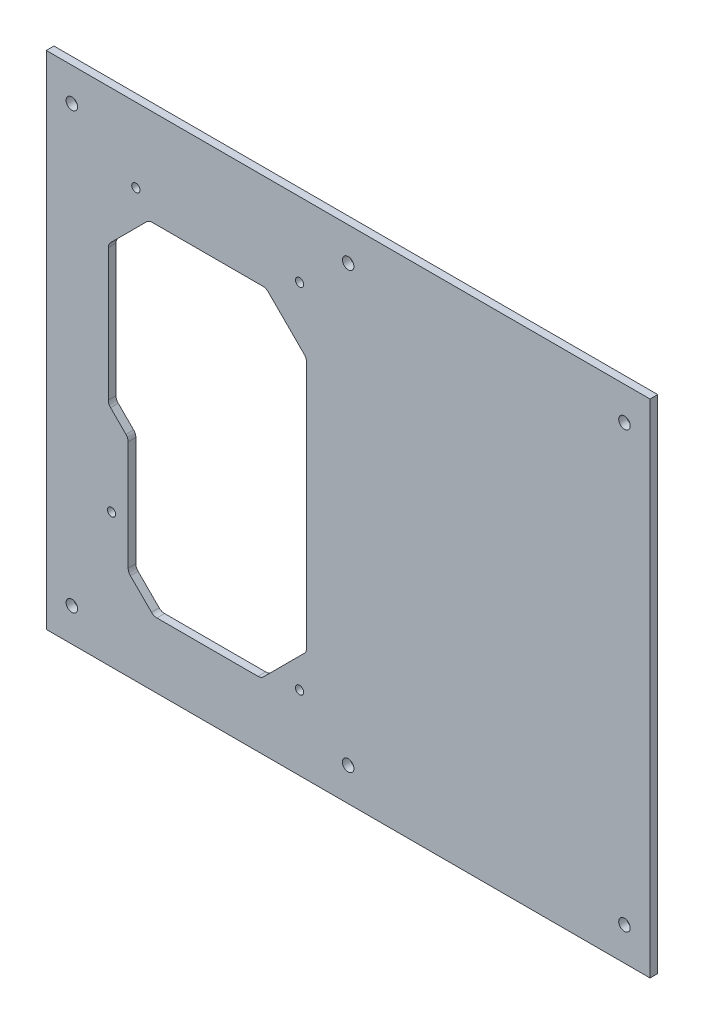
ISO-10303-21;
HEADER;
FILE_DESCRIPTION(('STEP AP214'),'2;1');
FILE_NAME('part.step','',(''),(''),'','','');
FILE_SCHEMA(('AUTOMOTIVE_DESIGN { 1 0 10303 214 1 1 1 1 }'));
ENDSEC;
DATA;
#1=APPLICATION_CONTEXT('core data for automotive mechanical design processes');
#2=APPLICATION_PROTOCOL_DEFINITION('international standard','automotive_design',2000,#1);
#3=PRODUCT_CONTEXT('',#1,'mechanical');
#4=PRODUCT('Part','Part','',(#3));
#5=PRODUCT_RELATED_PRODUCT_CATEGORY('part','',(#4));
#6=PRODUCT_DEFINITION_FORMATION('','',#4);
#7=PRODUCT_DEFINITION_CONTEXT('part definition',#1,'design');
#8=PRODUCT_DEFINITION('design','',#6,#7);
#9=PRODUCT_DEFINITION_SHAPE('','',#8);
#10=(LENGTH_UNIT() NAMED_UNIT(*) SI_UNIT(.MILLI.,.METRE.));
#11=(NAMED_UNIT(*) PLANE_ANGLE_UNIT() SI_UNIT($,.RADIAN.));
#12=(NAMED_UNIT(*) SI_UNIT($,.STERADIAN.) SOLID_ANGLE_UNIT());
#13=UNCERTAINTY_MEASURE_WITH_UNIT(LENGTH_MEASURE(1.E-05),#10,'distance_accuracy_value','');
#14=(GEOMETRIC_REPRESENTATION_CONTEXT(3) GLOBAL_UNCERTAINTY_ASSIGNED_CONTEXT((#13)) GLOBAL_UNIT_ASSIGNED_CONTEXT((#10,
#11,#12)) REPRESENTATION_CONTEXT('',''));
#15=CARTESIAN_POINT('',(0.,0.,0.));
#16=DIRECTION('',(0.,0.,1.));
#17=DIRECTION('',(1.,0.,0.));
#18=AXIS2_PLACEMENT_3D('',#15,#16,#17);
#19=CARTESIAN_POINT('',(0.,0.,3.));
#20=DIRECTION('',(0.,0.,-1.));
#21=DIRECTION('',(-1.,0.,0.));
#22=AXIS2_PLACEMENT_3D('',#19,#20,#21);
#23=PLANE('',#22);
#24=CARTESIAN_POINT('',(99.0000000000001,167.,3.));
#25=DIRECTION('',(0.,0.,1.));
#26=DIRECTION('',(-1.,0.,0.));
#27=AXIS2_PLACEMENT_3D('',#24,#25,#26);
#28=CIRCLE('',#27,1.6);
#29=CARTESIAN_POINT('',(97.4000000000001,167.,3.));
#30=VERTEX_POINT('',#29);
#31=EDGE_CURVE('E543',#30,#30,#28,.T.);
#32=ORIENTED_EDGE('',*,*,#31,.F.);
#33=EDGE_LOOP('',(#32));
#34=FACE_BOUND('',#33,.T.);
#35=CARTESIAN_POINT('',(35.0000000000001,167.000000000001,3.));
#36=DIRECTION('',(0.,0.,1.));
#37=DIRECTION('',(-1.,0.,0.));
#38=AXIS2_PLACEMENT_3D('',#35,#36,#37);
#39=CIRCLE('',#38,1.6);
#40=CARTESIAN_POINT('',(33.4000000000001,167.000000000001,3.));
#41=VERTEX_POINT('',#40);
#42=EDGE_CURVE('E551',#41,#41,#39,.T.);
#43=ORIENTED_EDGE('',*,*,#42,.F.);
#44=EDGE_LOOP('',(#43));
#45=FACE_BOUND('',#44,.T.);
#46=CARTESIAN_POINT('',(98.9999999999997,29.0000000000003,3.));
#47=DIRECTION('',(0.,0.,1.));
#48=DIRECTION('',(-1.,0.,0.));
#49=AXIS2_PLACEMENT_3D('',#46,#47,#48);
#50=CIRCLE('',#49,1.6);
#51=CARTESIAN_POINT('',(97.3999999999997,29.0000000000003,3.));
#52=VERTEX_POINT('',#51);
#53=EDGE_CURVE('E557',#52,#52,#50,.T.);
#54=ORIENTED_EDGE('',*,*,#53,.F.);
#55=EDGE_LOOP('',(#54));
#56=FACE_BOUND('',#55,.T.);
#57=CARTESIAN_POINT('',(25.4999999999998,52.5000000000005,3.));
#58=DIRECTION('',(0.,0.,1.));
#59=DIRECTION('',(-1.,0.,0.));
#60=AXIS2_PLACEMENT_3D('',#57,#58,#59);
#61=CIRCLE('',#60,1.6);
#62=CARTESIAN_POINT('',(23.8999999999998,52.5000000000005,3.));
#63=VERTEX_POINT('',#62);
#64=EDGE_CURVE('E365',#63,#63,#61,.T.);
#65=ORIENTED_EDGE('',*,*,#64,.F.);
#66=EDGE_LOOP('',(#65));
#67=FACE_BOUND('',#66,.T.);
#68=CARTESIAN_POINT('',(118.,13.,3.));
#69=DIRECTION('',(0.,0.,1.));
#70=DIRECTION('',(1.,0.,0.));
#71=AXIS2_PLACEMENT_3D('',#68,#69,#70);
#72=CIRCLE('',#71,2.25);
#73=CARTESIAN_POINT('',(120.25,13.,3.));
#74=VERTEX_POINT('',#73);
#75=EDGE_CURVE('E386',#74,#74,#72,.T.);
#76=ORIENTED_EDGE('',*,*,#75,.F.);
#77=EDGE_LOOP('',(#76));
#78=FACE_BOUND('',#77,.T.);
#79=CARTESIAN_POINT('',(118.,183.,3.));
#80=DIRECTION('',(0.,0.,1.));
#81=DIRECTION('',(1.,0.,0.));
#82=AXIS2_PLACEMENT_3D('',#79,#80,#81);
#83=CIRCLE('',#82,2.25000000000001);
#84=CARTESIAN_POINT('',(120.25,183.,3.));
#85=VERTEX_POINT('',#84);
#86=EDGE_CURVE('E392',#85,#85,#83,.T.);
#87=ORIENTED_EDGE('',*,*,#86,.F.);
#88=EDGE_LOOP('',(#87));
#89=FACE_BOUND('',#88,.T.);
#90=CARTESIAN_POINT('',(226.,13.,3.));
#91=DIRECTION('',(0.,0.,1.));
#92=DIRECTION('',(1.,0.,0.));
#93=AXIS2_PLACEMENT_3D('',#90,#91,#92);
#94=CIRCLE('',#93,2.25000000000001);
#95=CARTESIAN_POINT('',(228.25,13.,3.));
#96=VERTEX_POINT('',#95);
#97=EDGE_CURVE('E398',#96,#96,#94,.T.);
#98=ORIENTED_EDGE('',*,*,#97,.F.);
#99=EDGE_LOOP('',(#98));
#100=FACE_BOUND('',#99,.T.);
#101=CARTESIAN_POINT('',(226.,183.,3.));
#102=DIRECTION('',(0.,0.,1.));
#103=DIRECTION('',(1.,0.,0.));
#104=AXIS2_PLACEMENT_3D('',#101,#102,#103);
#105=CIRCLE('',#104,2.25000000000001);
#106=CARTESIAN_POINT('',(228.25,183.,3.));
#107=VERTEX_POINT('',#106);
#108=EDGE_CURVE('E404',#107,#107,#105,.T.);
#109=ORIENTED_EDGE('',*,*,#108,.F.);
#110=EDGE_LOOP('',(#109));
#111=FACE_BOUND('',#110,.T.);
#112=CARTESIAN_POINT('',(9.99999999999998,13.,3.));
#113=DIRECTION('',(0.,0.,1.));
#114=DIRECTION('',(1.,0.,0.));
#115=AXIS2_PLACEMENT_3D('',#112,#113,#114);
#116=CIRCLE('',#115,2.25);
#117=CARTESIAN_POINT('',(12.25,13.,3.));
#118=VERTEX_POINT('',#117);
#119=EDGE_CURVE('E410',#118,#118,#116,.T.);
#120=ORIENTED_EDGE('',*,*,#119,.F.);
#121=EDGE_LOOP('',(#120));
#122=FACE_BOUND('',#121,.T.);
#123=CARTESIAN_POINT('',(9.99999999999997,183.,3.));
#124=DIRECTION('',(0.,0.,1.));
#125=DIRECTION('',(1.,0.,0.));
#126=AXIS2_PLACEMENT_3D('',#123,#124,#125);
#127=CIRCLE('',#126,2.25);
#128=CARTESIAN_POINT('',(12.25,183.,3.));
#129=VERTEX_POINT('',#128);
#130=EDGE_CURVE('E416',#129,#129,#127,.T.);
#131=ORIENTED_EDGE('',*,*,#130,.F.);
#132=EDGE_LOOP('',(#131));
#133=FACE_BOUND('',#132,.T.);
#134=DIRECTION('',(0.,-1.,0.));
#135=VECTOR('',#134,1.);
#136=CARTESIAN_POINT('',(0.,0.,3.));
#137=LINE('',#136,#135);
#138=CARTESIAN_POINT('',(0.,196.,3.));
#139=VERTEX_POINT('',#138);
#140=CARTESIAN_POINT('',(0.,0.,3.));
#141=VERTEX_POINT('',#140);
#142=EDGE_CURVE('E209',#139,#141,#137,.T.);
#143=ORIENTED_EDGE('',*,*,#142,.T.);
#144=DIRECTION('',(1.,0.,0.));
#145=VECTOR('',#144,1.);
#146=CARTESIAN_POINT('',(0.,0.,3.));
#147=LINE('',#146,#145);
#148=CARTESIAN_POINT('',(236.,0.,3.));
#149=VERTEX_POINT('',#148);
#150=EDGE_CURVE('E198',#141,#149,#147,.T.);
#151=ORIENTED_EDGE('',*,*,#150,.T.);
#152=DIRECTION('',(0.,1.,0.));
#153=VECTOR('',#152,1.);
#154=CARTESIAN_POINT('',(236.,0.,3.));
#155=LINE('',#154,#153);
#156=CARTESIAN_POINT('',(236.,196.,3.));
#157=VERTEX_POINT('',#156);
#158=EDGE_CURVE('E208',#149,#157,#155,.T.);
#159=ORIENTED_EDGE('',*,*,#158,.T.);
#160=DIRECTION('',(-1.,0.,0.));
#161=VECTOR('',#160,1.);
#162=CARTESIAN_POINT('',(0.,196.,3.));
#163=LINE('',#162,#161);
#164=EDGE_CURVE('E213',#157,#139,#163,.T.);
#165=ORIENTED_EDGE('',*,*,#164,.T.);
#166=EDGE_LOOP('',(#143,#151,#159,#165));
#167=FACE_BOUND('',#166,.T.);
#168=DIRECTION('',(0.,-1.,0.));
#169=VECTOR('',#168,1.);
#170=CARTESIAN_POINT('',(32.0000000000009,35.500000000001,3.));
#171=LINE('',#170,#169);
#172=CARTESIAN_POINT('',(32.0000000000011,79.5073593128805,3.));
#173=VERTEX_POINT('',#172);
#174=CARTESIAN_POINT('',(32.000000000001,36.7426406871203,3.));
#175=VERTEX_POINT('',#174);
#176=EDGE_CURVE('E334',#173,#175,#171,.T.);
#177=ORIENTED_EDGE('',*,*,#176,.F.);
#178=CARTESIAN_POINT('',(29.0000000000011,79.5073593128805,3.));
#179=DIRECTION('',(0.,0.,-1.));
#180=DIRECTION('',(-1.,0.,0.));
#181=AXIS2_PLACEMENT_3D('',#178,#179,#180);
#182=CIRCLE('',#181,3.);
#183=CARTESIAN_POINT('',(31.1213203435607,81.6286796564402,3.));
#184=VERTEX_POINT('',#183);
#185=EDGE_CURVE('E51',#173,#184,#182,.F.);
#186=ORIENTED_EDGE('',*,*,#185,.T.);
#187=DIRECTION('',(0.707106781186566,-0.707106781186529,0.));
#188=VECTOR('',#187,1.);
#189=CARTESIAN_POINT('',(32.0000000000011,80.7499999999998,3.));
#190=LINE('',#189,#188);
#191=CARTESIAN_POINT('',(25.1286796564399,87.6213203435606,3.));
#192=VERTEX_POINT('',#191);
#193=EDGE_CURVE('E328',#192,#184,#190,.T.);
#194=ORIENTED_EDGE('',*,*,#193,.F.);
#195=CARTESIAN_POINT('',(27.2499999999995,89.7426406871203,3.));
#196=DIRECTION('',(0.,0.,-1.));
#197=DIRECTION('',(-1.,0.,0.));
#198=AXIS2_PLACEMENT_3D('',#195,#196,#197);
#199=CIRCLE('',#198,3.);
#200=CARTESIAN_POINT('',(24.2499999999995,89.7426406871203,3.));
#201=VERTEX_POINT('',#200);
#202=EDGE_CURVE('E11',#192,#201,#199,.T.);
#203=ORIENTED_EDGE('',*,*,#202,.T.);
#204=DIRECTION('',(0.,-1.,0.));
#205=VECTOR('',#204,1.);
#206=CARTESIAN_POINT('',(24.2499999999995,88.500000000001,3.));
#207=LINE('',#206,#205);
#208=CARTESIAN_POINT('',(24.2499999999995,141.386147890153,3.));
#209=VERTEX_POINT('',#208);
#210=EDGE_CURVE('E326',#209,#201,#207,.T.);
#211=ORIENTED_EDGE('',*,*,#210,.F.);
#212=CARTESIAN_POINT('',(27.2499999999995,141.386147890153,3.));
#213=DIRECTION('',(0.,0.,-1.));
#214=DIRECTION('',(-1.,0.,0.));
#215=AXIS2_PLACEMENT_3D('',#212,#213,#214);
#216=CIRCLE('',#215,3.);
#217=CARTESIAN_POINT('',(25.1286796564399,143.507468233713,3.));
#218=VERTEX_POINT('',#217);
#219=EDGE_CURVE('E281',#209,#218,#216,.T.);
#220=ORIENTED_EDGE('',*,*,#219,.T.);
#221=DIRECTION('',(-0.707106781186543,-0.707106781186552,0.));
#222=VECTOR('',#221,1.);
#223=CARTESIAN_POINT('',(40.1212114227278,158.500000000001,3.));
#224=LINE('',#223,#222);
#225=CARTESIAN_POINT('',(39.2425317662874,157.621320343561,3.));
#226=VERTEX_POINT('',#225);
#227=EDGE_CURVE('E332',#226,#218,#224,.T.);
#228=ORIENTED_EDGE('',*,*,#227,.F.);
#229=CARTESIAN_POINT('',(41.3638521098471,155.500000000001,3.));
#230=DIRECTION('',(0.,0.,-1.));
#231=DIRECTION('',(-1.,0.,0.));
#232=AXIS2_PLACEMENT_3D('',#229,#230,#231);
#233=CIRCLE('',#232,3.);
#234=CARTESIAN_POINT('',(41.3638521098471,158.500000000001,3.));
#235=VERTEX_POINT('',#234);
#236=EDGE_CURVE('E285',#226,#235,#233,.T.);
#237=ORIENTED_EDGE('',*,*,#236,.T.);
#238=DIRECTION('',(-1.,0.,0.));
#239=VECTOR('',#238,1.);
#240=CARTESIAN_POINT('',(40.1212114227278,158.500000000001,3.));
#241=LINE('',#240,#239);
#242=CARTESIAN_POINT('',(84.6361064175719,158.500000000001,3.));
#243=VERTEX_POINT('',#242);
#244=EDGE_CURVE('E358',#243,#235,#241,.T.);
#245=ORIENTED_EDGE('',*,*,#244,.F.);
#246=CARTESIAN_POINT('',(84.6361064175719,155.500000000001,3.));
#247=DIRECTION('',(0.,0.,-1.));
#248=DIRECTION('',(-1.,0.,0.));
#249=AXIS2_PLACEMENT_3D('',#246,#247,#248);
#250=CIRCLE('',#249,3.);
#251=CARTESIAN_POINT('',(86.7574267611317,157.62132034356,3.));
#252=VERTEX_POINT('',#251);
#253=EDGE_CURVE('E289',#243,#252,#250,.T.);
#254=ORIENTED_EDGE('',*,*,#253,.T.);
#255=DIRECTION('',(-0.707106781186491,0.707106781186604,0.));
#256=VECTOR('',#255,1.);
#257=CARTESIAN_POINT('',(101.75,142.62874710469,3.));
#258=LINE('',#257,#256);
#259=CARTESIAN_POINT('',(100.87132034356,143.50742676113,3.));
#260=VERTEX_POINT('',#259);
#261=EDGE_CURVE('E355',#260,#252,#258,.T.);
#262=ORIENTED_EDGE('',*,*,#261,.F.);
#263=CARTESIAN_POINT('',(98.7499999999999,141.386106417571,3.));
#264=DIRECTION('',(0.,0.,-1.));
#265=DIRECTION('',(-1.,0.,0.));
#266=AXIS2_PLACEMENT_3D('',#263,#264,#265);
#267=CIRCLE('',#266,3.);
#268=CARTESIAN_POINT('',(101.75,141.386106417571,3.));
#269=VERTEX_POINT('',#268);
#270=EDGE_CURVE('E293',#260,#269,#267,.T.);
#271=ORIENTED_EDGE('',*,*,#270,.T.);
#272=DIRECTION('',(0.,1.,0.));
#273=VECTOR('',#272,1.);
#274=CARTESIAN_POINT('',(101.75,142.62874710469,3.));
#275=LINE('',#274,#273);
#276=CARTESIAN_POINT('',(101.75,44.4926406871193,3.));
#277=VERTEX_POINT('',#276);
#278=EDGE_CURVE('E352',#277,#269,#275,.T.);
#279=ORIENTED_EDGE('',*,*,#278,.F.);
#280=CARTESIAN_POINT('',(98.7500000000002,44.4926406871193,3.));
#281=DIRECTION('',(0.,0.,-1.));
#282=DIRECTION('',(-1.,0.,0.));
#283=AXIS2_PLACEMENT_3D('',#280,#281,#282);
#284=CIRCLE('',#283,3.);
#285=CARTESIAN_POINT('',(100.87132034356,42.3713203435597,3.));
#286=VERTEX_POINT('',#285);
#287=EDGE_CURVE('E297',#277,#286,#284,.T.);
#288=ORIENTED_EDGE('',*,*,#287,.T.);
#289=DIRECTION('',(0.707106781186556,0.707106781186539,0.));
#290=VECTOR('',#289,1.);
#291=CARTESIAN_POINT('',(101.75,43.25,3.));
#292=LINE('',#291,#290);
#293=CARTESIAN_POINT('',(84.8786796564409,26.3786796564411,3.));
#294=VERTEX_POINT('',#293);
#295=EDGE_CURVE('E349',#294,#286,#292,.T.);
#296=ORIENTED_EDGE('',*,*,#295,.F.);
#297=CARTESIAN_POINT('',(82.7573593128813,28.5000000000008,3.));
#298=DIRECTION('',(0.,0.,-1.));
#299=DIRECTION('',(-1.,0.,0.));
#300=AXIS2_PLACEMENT_3D('',#297,#298,#299);
#301=CIRCLE('',#300,3.);
#302=CARTESIAN_POINT('',(82.7573593128813,25.5000000000008,3.));
#303=VERTEX_POINT('',#302);
#304=EDGE_CURVE('E301',#294,#303,#301,.T.);
#305=ORIENTED_EDGE('',*,*,#304,.T.);
#306=DIRECTION('',(1.,0.,0.));
#307=VECTOR('',#306,1.);
#308=CARTESIAN_POINT('',(84.0000000000005,25.5000000000008,3.));
#309=LINE('',#308,#307);
#310=CARTESIAN_POINT('',(43.2426406871203,25.5000000000008,3.));
#311=VERTEX_POINT('',#310);
#312=EDGE_CURVE('E346',#311,#303,#309,.T.);
#313=ORIENTED_EDGE('',*,*,#312,.F.);
#314=CARTESIAN_POINT('',(43.2426406871203,28.5000000000008,3.));
#315=DIRECTION('',(0.,0.,-1.));
#316=DIRECTION('',(-1.,0.,0.));
#317=AXIS2_PLACEMENT_3D('',#314,#315,#316);
#318=CIRCLE('',#317,3.);
#319=CARTESIAN_POINT('',(41.1213203435607,26.3786796564412,3.));
#320=VERTEX_POINT('',#319);
#321=EDGE_CURVE('E305',#311,#320,#318,.T.);
#322=ORIENTED_EDGE('',*,*,#321,.T.);
#323=DIRECTION('',(0.707106781186542,-0.707106781186553,0.));
#324=VECTOR('',#323,1.);
#325=CARTESIAN_POINT('',(42.000000000001,25.5000000000008,3.));
#326=LINE('',#325,#324);
#327=CARTESIAN_POINT('',(32.8786796564413,34.6213203435607,3.));
#328=VERTEX_POINT('',#327);
#329=EDGE_CURVE('E343',#328,#320,#326,.T.);
#330=ORIENTED_EDGE('',*,*,#329,.F.);
#331=CARTESIAN_POINT('',(35.000000000001,36.7426406871203,3.));
#332=DIRECTION('',(0.,0.,-1.));
#333=DIRECTION('',(-1.,0.,0.));
#334=AXIS2_PLACEMENT_3D('',#331,#332,#333);
#335=CIRCLE('',#334,3.);
#336=EDGE_CURVE('E309',#328,#175,#335,.T.);
#337=ORIENTED_EDGE('',*,*,#336,.T.);
#338=EDGE_LOOP('',(#177,#186,#194,#203,#211,#220,#228,#237,#245,#254,#262,#271,#279,#288,#296,
#305,#313,#322,#330,#337));
#339=FACE_BOUND('',#338,.T.);
#340=ADVANCED_FACE('F36',(#34,#45,#56,#67,#78,#89,#100,#111,#122,#133,#167,#339),#23,.F.);
#341=CARTESIAN_POINT('',(0.,0.,0.));
#342=DIRECTION('',(0.,0.,-1.));
#343=DIRECTION('',(-1.,0.,0.));
#344=AXIS2_PLACEMENT_3D('',#341,#342,#343);
#345=PLANE('',#344);
#346=CARTESIAN_POINT('',(99.0000000000001,167.,0.));
#347=DIRECTION('',(0.,0.,1.));
#348=DIRECTION('',(-1.,0.,0.));
#349=AXIS2_PLACEMENT_3D('',#346,#347,#348);
#350=CIRCLE('',#349,1.6);
#351=CARTESIAN_POINT('',(97.4000000000001,167.,0.));
#352=VERTEX_POINT('',#351);
#353=EDGE_CURVE('E546',#352,#352,#350,.T.);
#354=ORIENTED_EDGE('',*,*,#353,.T.);
#355=EDGE_LOOP('',(#354));
#356=FACE_BOUND('',#355,.T.);
#357=CARTESIAN_POINT('',(35.0000000000001,167.000000000001,0.));
#358=DIRECTION('',(0.,0.,1.));
#359=DIRECTION('',(-1.,0.,0.));
#360=AXIS2_PLACEMENT_3D('',#357,#358,#359);
#361=CIRCLE('',#360,1.6);
#362=CARTESIAN_POINT('',(33.4000000000001,167.000000000001,0.));
#363=VERTEX_POINT('',#362);
#364=EDGE_CURVE('E548',#363,#363,#361,.T.);
#365=ORIENTED_EDGE('',*,*,#364,.T.);
#366=EDGE_LOOP('',(#365));
#367=FACE_BOUND('',#366,.T.);
#368=CARTESIAN_POINT('',(98.9999999999997,29.0000000000003,0.));
#369=DIRECTION('',(0.,0.,1.));
#370=DIRECTION('',(-1.,0.,0.));
#371=AXIS2_PLACEMENT_3D('',#368,#369,#370);
#372=CIRCLE('',#371,1.6);
#373=CARTESIAN_POINT('',(97.3999999999997,29.0000000000003,0.));
#374=VERTEX_POINT('',#373);
#375=EDGE_CURVE('E554',#374,#374,#372,.T.);
#376=ORIENTED_EDGE('',*,*,#375,.T.);
#377=EDGE_LOOP('',(#376));
#378=FACE_BOUND('',#377,.T.);
#379=CARTESIAN_POINT('',(25.4999999999998,52.5000000000005,0.));
#380=DIRECTION('',(0.,0.,1.));
#381=DIRECTION('',(-1.,0.,0.));
#382=AXIS2_PLACEMENT_3D('',#379,#380,#381);
#383=CIRCLE('',#382,1.6);
#384=CARTESIAN_POINT('',(23.8999999999998,52.5000000000005,0.));
#385=VERTEX_POINT('',#384);
#386=EDGE_CURVE('E560',#385,#385,#383,.T.);
#387=ORIENTED_EDGE('',*,*,#386,.T.);
#388=EDGE_LOOP('',(#387));
#389=FACE_BOUND('',#388,.T.);
#390=CARTESIAN_POINT('',(118.,183.,0.));
#391=DIRECTION('',(0.,0.,1.));
#392=DIRECTION('',(1.,0.,0.));
#393=AXIS2_PLACEMENT_3D('',#390,#391,#392);
#394=CIRCLE('',#393,2.25000000000001);
#395=CARTESIAN_POINT('',(120.25,183.,0.));
#396=VERTEX_POINT('',#395);
#397=EDGE_CURVE('E389',#396,#396,#394,.T.);
#398=ORIENTED_EDGE('',*,*,#397,.T.);
#399=EDGE_LOOP('',(#398));
#400=FACE_BOUND('',#399,.T.);
#401=CARTESIAN_POINT('',(226.,183.,0.));
#402=DIRECTION('',(0.,0.,1.));
#403=DIRECTION('',(1.,0.,0.));
#404=AXIS2_PLACEMENT_3D('',#401,#402,#403);
#405=CIRCLE('',#404,2.25000000000001);
#406=CARTESIAN_POINT('',(228.25,183.,0.));
#407=VERTEX_POINT('',#406);
#408=EDGE_CURVE('E401',#407,#407,#405,.T.);
#409=ORIENTED_EDGE('',*,*,#408,.T.);
#410=EDGE_LOOP('',(#409));
#411=FACE_BOUND('',#410,.T.);
#412=CARTESIAN_POINT('',(9.99999999999997,183.,0.));
#413=DIRECTION('',(0.,0.,1.));
#414=DIRECTION('',(1.,0.,0.));
#415=AXIS2_PLACEMENT_3D('',#412,#413,#414);
#416=CIRCLE('',#415,2.25);
#417=CARTESIAN_POINT('',(12.25,183.,0.));
#418=VERTEX_POINT('',#417);
#419=EDGE_CURVE('E413',#418,#418,#416,.T.);
#420=ORIENTED_EDGE('',*,*,#419,.T.);
#421=EDGE_LOOP('',(#420));
#422=FACE_BOUND('',#421,.T.);
#423=DIRECTION('',(0.,-1.,0.));
#424=VECTOR('',#423,1.);
#425=CARTESIAN_POINT('',(0.,0.,0.));
#426=LINE('',#425,#424);
#427=CARTESIAN_POINT('',(0.,196.,0.));
#428=VERTEX_POINT('',#427);
#429=CARTESIAN_POINT('',(0.,0.,0.));
#430=VERTEX_POINT('',#429);
#431=EDGE_CURVE('E221',#428,#430,#426,.T.);
#432=ORIENTED_EDGE('',*,*,#431,.F.);
#433=DIRECTION('',(-1.,0.,0.));
#434=VECTOR('',#433,1.);
#435=CARTESIAN_POINT('',(0.,196.,0.));
#436=LINE('',#435,#434);
#437=CARTESIAN_POINT('',(236.,196.,0.));
#438=VERTEX_POINT('',#437);
#439=EDGE_CURVE('E217',#438,#428,#436,.T.);
#440=ORIENTED_EDGE('',*,*,#439,.F.);
#441=DIRECTION('',(0.,1.,0.));
#442=VECTOR('',#441,1.);
#443=CARTESIAN_POINT('',(236.,0.,0.));
#444=LINE('',#443,#442);
#445=CARTESIAN_POINT('',(236.,0.,0.));
#446=VERTEX_POINT('',#445);
#447=EDGE_CURVE('E427',#446,#438,#444,.T.);
#448=ORIENTED_EDGE('',*,*,#447,.F.);
#449=DIRECTION('',(1.,0.,0.));
#450=VECTOR('',#449,1.);
#451=CARTESIAN_POINT('',(0.,0.,0.));
#452=LINE('',#451,#450);
#453=EDGE_CURVE('E425',#430,#446,#452,.T.);
#454=ORIENTED_EDGE('',*,*,#453,.F.);
#455=EDGE_LOOP('',(#432,#440,#448,#454));
#456=FACE_BOUND('',#455,.T.);
#457=CARTESIAN_POINT('',(9.99999999999998,13.,0.));
#458=DIRECTION('',(0.,0.,1.));
#459=DIRECTION('',(1.,0.,0.));
#460=AXIS2_PLACEMENT_3D('',#457,#458,#459);
#461=CIRCLE('',#460,2.25);
#462=CARTESIAN_POINT('',(12.25,13.,0.));
#463=VERTEX_POINT('',#462);
#464=EDGE_CURVE('E407',#463,#463,#461,.T.);
#465=ORIENTED_EDGE('',*,*,#464,.T.);
#466=EDGE_LOOP('',(#465));
#467=FACE_BOUND('',#466,.T.);
#468=CARTESIAN_POINT('',(226.,13.,0.));
#469=DIRECTION('',(0.,0.,1.));
#470=DIRECTION('',(1.,0.,0.));
#471=AXIS2_PLACEMENT_3D('',#468,#469,#470);
#472=CIRCLE('',#471,2.25000000000001);
#473=CARTESIAN_POINT('',(228.25,13.,0.));
#474=VERTEX_POINT('',#473);
#475=EDGE_CURVE('E395',#474,#474,#472,.T.);
#476=ORIENTED_EDGE('',*,*,#475,.T.);
#477=EDGE_LOOP('',(#476));
#478=FACE_BOUND('',#477,.T.);
#479=CARTESIAN_POINT('',(118.,13.,0.));
#480=DIRECTION('',(0.,0.,1.));
#481=DIRECTION('',(1.,0.,0.));
#482=AXIS2_PLACEMENT_3D('',#479,#480,#481);
#483=CIRCLE('',#482,2.25);
#484=CARTESIAN_POINT('',(120.25,13.,0.));
#485=VERTEX_POINT('',#484);
#486=EDGE_CURVE('E361',#485,#485,#483,.T.);
#487=ORIENTED_EDGE('',*,*,#486,.T.);
#488=EDGE_LOOP('',(#487));
#489=FACE_BOUND('',#488,.T.);
#490=DIRECTION('',(0.707106781186566,-0.707106781186529,0.));
#491=VECTOR('',#490,1.);
#492=CARTESIAN_POINT('',(32.0000000000011,80.7499999999998,0.));
#493=LINE('',#492,#491);
#494=CARTESIAN_POINT('',(25.1286796564399,87.6213203435606,0.));
#495=VERTEX_POINT('',#494);
#496=CARTESIAN_POINT('',(31.1213203435607,81.6286796564402,0.));
#497=VERTEX_POINT('',#496);
#498=EDGE_CURVE('E314',#495,#497,#493,.T.);
#499=ORIENTED_EDGE('',*,*,#498,.T.);
#500=CARTESIAN_POINT('',(29.0000000000011,79.5073593128805,0.));
#501=DIRECTION('',(0.,0.,-1.));
#502=DIRECTION('',(-1.,0.,0.));
#503=AXIS2_PLACEMENT_3D('',#500,#501,#502);
#504=CIRCLE('',#503,3.);
#505=CARTESIAN_POINT('',(32.0000000000011,79.5073593128805,0.));
#506=VERTEX_POINT('',#505);
#507=EDGE_CURVE('E276',#497,#506,#504,.T.);
#508=ORIENTED_EDGE('',*,*,#507,.T.);
#509=DIRECTION('',(0.,-1.,0.));
#510=VECTOR('',#509,1.);
#511=CARTESIAN_POINT('',(32.0000000000009,35.500000000001,0.));
#512=LINE('',#511,#510);
#513=CARTESIAN_POINT('',(32.000000000001,36.7426406871203,0.));
#514=VERTEX_POINT('',#513);
#515=EDGE_CURVE('E321',#506,#514,#512,.T.);
#516=ORIENTED_EDGE('',*,*,#515,.T.);
#517=CARTESIAN_POINT('',(35.000000000001,36.7426406871203,0.));
#518=DIRECTION('',(0.,0.,-1.));
#519=DIRECTION('',(-1.,0.,0.));
#520=AXIS2_PLACEMENT_3D('',#517,#518,#519);
#521=CIRCLE('',#520,3.);
#522=CARTESIAN_POINT('',(32.8786796564413,34.6213203435607,0.));
#523=VERTEX_POINT('',#522);
#524=EDGE_CURVE('E307',#514,#523,#521,.F.);
#525=ORIENTED_EDGE('',*,*,#524,.T.);
#526=DIRECTION('',(0.707106781186542,-0.707106781186553,0.));
#527=VECTOR('',#526,1.);
#528=CARTESIAN_POINT('',(42.000000000001,25.5000000000008,0.));
#529=LINE('',#528,#527);
#530=CARTESIAN_POINT('',(41.1213203435607,26.3786796564412,0.));
#531=VERTEX_POINT('',#530);
#532=EDGE_CURVE('E369',#523,#531,#529,.T.);
#533=ORIENTED_EDGE('',*,*,#532,.T.);
#534=CARTESIAN_POINT('',(43.2426406871203,28.5000000000008,0.));
#535=DIRECTION('',(0.,0.,-1.));
#536=DIRECTION('',(-1.,0.,0.));
#537=AXIS2_PLACEMENT_3D('',#534,#535,#536);
#538=CIRCLE('',#537,3.);
#539=CARTESIAN_POINT('',(43.2426406871203,25.5000000000008,0.));
#540=VERTEX_POINT('',#539);
#541=EDGE_CURVE('E303',#531,#540,#538,.F.);
#542=ORIENTED_EDGE('',*,*,#541,.T.);
#543=DIRECTION('',(1.,0.,0.));
#544=VECTOR('',#543,1.);
#545=CARTESIAN_POINT('',(84.0000000000005,25.5000000000008,0.));
#546=LINE('',#545,#544);
#547=CARTESIAN_POINT('',(82.7573593128813,25.5000000000008,0.));
#548=VERTEX_POINT('',#547);
#549=EDGE_CURVE('E372',#540,#548,#546,.T.);
#550=ORIENTED_EDGE('',*,*,#549,.T.);
#551=CARTESIAN_POINT('',(82.7573593128813,28.5000000000008,0.));
#552=DIRECTION('',(0.,0.,-1.));
#553=DIRECTION('',(-1.,0.,0.));
#554=AXIS2_PLACEMENT_3D('',#551,#552,#553);
#555=CIRCLE('',#554,3.);
#556=CARTESIAN_POINT('',(84.8786796564409,26.3786796564411,0.));
#557=VERTEX_POINT('',#556);
#558=EDGE_CURVE('E299',#548,#557,#555,.F.);
#559=ORIENTED_EDGE('',*,*,#558,.T.);
#560=DIRECTION('',(0.707106781186556,0.707106781186539,0.));
#561=VECTOR('',#560,1.);
#562=CARTESIAN_POINT('',(101.75,43.25,0.));
#563=LINE('',#562,#561);
#564=CARTESIAN_POINT('',(100.87132034356,42.3713203435597,0.));
#565=VERTEX_POINT('',#564);
#566=EDGE_CURVE('E375',#557,#565,#563,.T.);
#567=ORIENTED_EDGE('',*,*,#566,.T.);
#568=CARTESIAN_POINT('',(98.7500000000002,44.4926406871193,0.));
#569=DIRECTION('',(0.,0.,-1.));
#570=DIRECTION('',(-1.,0.,0.));
#571=AXIS2_PLACEMENT_3D('',#568,#569,#570);
#572=CIRCLE('',#571,3.);
#573=CARTESIAN_POINT('',(101.75,44.4926406871193,0.));
#574=VERTEX_POINT('',#573);
#575=EDGE_CURVE('E295',#565,#574,#572,.F.);
#576=ORIENTED_EDGE('',*,*,#575,.T.);
#577=DIRECTION('',(0.,1.,0.));
#578=VECTOR('',#577,1.);
#579=CARTESIAN_POINT('',(101.75,142.62874710469,0.));
#580=LINE('',#579,#578);
#581=CARTESIAN_POINT('',(101.75,141.386106417571,0.));
#582=VERTEX_POINT('',#581);
#583=EDGE_CURVE('E378',#574,#582,#580,.T.);
#584=ORIENTED_EDGE('',*,*,#583,.T.);
#585=CARTESIAN_POINT('',(98.7499999999999,141.386106417571,0.));
#586=DIRECTION('',(0.,0.,-1.));
#587=DIRECTION('',(-1.,0.,0.));
#588=AXIS2_PLACEMENT_3D('',#585,#586,#587);
#589=CIRCLE('',#588,3.);
#590=CARTESIAN_POINT('',(100.87132034356,143.50742676113,0.));
#591=VERTEX_POINT('',#590);
#592=EDGE_CURVE('E291',#582,#591,#589,.F.);
#593=ORIENTED_EDGE('',*,*,#592,.T.);
#594=DIRECTION('',(-0.707106781186491,0.707106781186604,0.));
#595=VECTOR('',#594,1.);
#596=CARTESIAN_POINT('',(101.75,142.62874710469,0.));
#597=LINE('',#596,#595);
#598=CARTESIAN_POINT('',(86.7574267611317,157.62132034356,0.));
#599=VERTEX_POINT('',#598);
#600=EDGE_CURVE('E381',#591,#599,#597,.T.);
#601=ORIENTED_EDGE('',*,*,#600,.T.);
#602=CARTESIAN_POINT('',(84.6361064175719,155.500000000001,0.));
#603=DIRECTION('',(0.,0.,-1.));
#604=DIRECTION('',(-1.,0.,0.));
#605=AXIS2_PLACEMENT_3D('',#602,#603,#604);
#606=CIRCLE('',#605,3.);
#607=CARTESIAN_POINT('',(84.6361064175719,158.500000000001,0.));
#608=VERTEX_POINT('',#607);
#609=EDGE_CURVE('E287',#599,#608,#606,.F.);
#610=ORIENTED_EDGE('',*,*,#609,.T.);
#611=DIRECTION('',(-1.,0.,0.));
#612=VECTOR('',#611,1.);
#613=CARTESIAN_POINT('',(40.1212114227278,158.500000000001,0.));
#614=LINE('',#613,#612);
#615=CARTESIAN_POINT('',(41.3638521098471,158.500000000001,0.));
#616=VERTEX_POINT('',#615);
#617=EDGE_CURVE('E337',#608,#616,#614,.T.);
#618=ORIENTED_EDGE('',*,*,#617,.T.);
#619=CARTESIAN_POINT('',(41.3638521098471,155.500000000001,0.));
#620=DIRECTION('',(0.,0.,-1.));
#621=DIRECTION('',(-1.,0.,0.));
#622=AXIS2_PLACEMENT_3D('',#619,#620,#621);
#623=CIRCLE('',#622,3.);
#624=CARTESIAN_POINT('',(39.2425317662874,157.621320343561,0.));
#625=VERTEX_POINT('',#624);
#626=EDGE_CURVE('E283',#616,#625,#623,.F.);
#627=ORIENTED_EDGE('',*,*,#626,.T.);
#628=DIRECTION('',(-0.707106781186543,-0.707106781186552,0.));
#629=VECTOR('',#628,1.);
#630=CARTESIAN_POINT('',(40.1212114227278,158.500000000001,0.));
#631=LINE('',#630,#629);
#632=CARTESIAN_POINT('',(25.1286796564399,143.507468233713,0.));
#633=VERTEX_POINT('',#632);
#634=EDGE_CURVE('E362',#625,#633,#631,.T.);
#635=ORIENTED_EDGE('',*,*,#634,.T.);
#636=CARTESIAN_POINT('',(27.2499999999995,141.386147890153,0.));
#637=DIRECTION('',(0.,0.,-1.));
#638=DIRECTION('',(-1.,0.,0.));
#639=AXIS2_PLACEMENT_3D('',#636,#637,#638);
#640=CIRCLE('',#639,3.);
#641=CARTESIAN_POINT('',(24.2499999999995,141.386147890153,0.));
#642=VERTEX_POINT('',#641);
#643=EDGE_CURVE('E279',#633,#642,#640,.F.);
#644=ORIENTED_EDGE('',*,*,#643,.T.);
#645=DIRECTION('',(0.,-1.,0.));
#646=VECTOR('',#645,1.);
#647=CARTESIAN_POINT('',(24.2499999999995,88.500000000001,0.));
#648=LINE('',#647,#646);
#649=CARTESIAN_POINT('',(24.2499999999995,89.7426406871203,0.));
#650=VERTEX_POINT('',#649);
#651=EDGE_CURVE('E316',#642,#650,#648,.T.);
#652=ORIENTED_EDGE('',*,*,#651,.T.);
#653=CARTESIAN_POINT('',(27.2499999999995,89.7426406871203,0.));
#654=DIRECTION('',(0.,0.,-1.));
#655=DIRECTION('',(-1.,0.,0.));
#656=AXIS2_PLACEMENT_3D('',#653,#654,#655);
#657=CIRCLE('',#656,3.);
#658=EDGE_CURVE('E44',#650,#495,#657,.F.);
#659=ORIENTED_EDGE('',*,*,#658,.T.);
#660=EDGE_LOOP('',(#499,#508,#516,#525,#533,#542,#550,#559,#567,#576,#584,#593,#601,#610,#618,
#627,#635,#644,#652,#659));
#661=FACE_BOUND('',#660,.T.);
#662=ADVANCED_FACE('F313',(#356,#367,#378,#389,#400,#411,#422,#456,#467,#478,#489,#661),#345,.T.);
#663=CARTESIAN_POINT('',(0.,0.,3.));
#664=DIRECTION('',(1.,0.,0.));
#665=DIRECTION('',(0.,1.,0.));
#666=AXIS2_PLACEMENT_3D('',#663,#664,#665);
#667=PLANE('',#666);
#668=ORIENTED_EDGE('',*,*,#431,.T.);
#669=DIRECTION('',(0.,0.,-1.));
#670=VECTOR('',#669,1.);
#671=CARTESIAN_POINT('',(0.,0.,3.));
#672=LINE('',#671,#670);
#673=EDGE_CURVE('E202',#141,#430,#672,.T.);
#674=ORIENTED_EDGE('',*,*,#673,.F.);
#675=ORIENTED_EDGE('',*,*,#142,.F.);
#676=DIRECTION('',(0.,0.,-1.));
#677=VECTOR('',#676,1.);
#678=CARTESIAN_POINT('',(0.,196.,3.));
#679=LINE('',#678,#677);
#680=EDGE_CURVE('E423',#139,#428,#679,.T.);
#681=ORIENTED_EDGE('',*,*,#680,.T.);
#682=EDGE_LOOP('',(#668,#674,#675,#681));
#683=FACE_BOUND('',#682,.T.);
#684=ADVANCED_FACE('F219',(#683),#667,.F.);
#685=CARTESIAN_POINT('',(0.,0.,3.));
#686=DIRECTION('',(0.,1.,0.));
#687=DIRECTION('',(0.,0.,1.));
#688=AXIS2_PLACEMENT_3D('',#685,#686,#687);
#689=PLANE('',#688);
#690=ORIENTED_EDGE('',*,*,#453,.T.);
#691=DIRECTION('',(0.,0.,-1.));
#692=VECTOR('',#691,1.);
#693=CARTESIAN_POINT('',(236.,0.,3.));
#694=LINE('',#693,#692);
#695=EDGE_CURVE('E205',#149,#446,#694,.T.);
#696=ORIENTED_EDGE('',*,*,#695,.F.);
#697=ORIENTED_EDGE('',*,*,#150,.F.);
#698=ORIENTED_EDGE('',*,*,#673,.T.);
#699=EDGE_LOOP('',(#690,#696,#697,#698));
#700=FACE_BOUND('',#699,.T.);
#701=ADVANCED_FACE('F200',(#700),#689,.F.);
#702=CARTESIAN_POINT('',(236.,0.,3.));
#703=DIRECTION('',(-1.,0.,0.));
#704=DIRECTION('',(0.,-1.,0.));
#705=AXIS2_PLACEMENT_3D('',#702,#703,#704);
#706=PLANE('',#705);
#707=ORIENTED_EDGE('',*,*,#447,.T.);
#708=DIRECTION('',(0.,0.,-1.));
#709=VECTOR('',#708,1.);
#710=CARTESIAN_POINT('',(236.,196.,3.));
#711=LINE('',#710,#709);
#712=EDGE_CURVE('E226',#157,#438,#711,.T.);
#713=ORIENTED_EDGE('',*,*,#712,.F.);
#714=ORIENTED_EDGE('',*,*,#158,.F.);
#715=ORIENTED_EDGE('',*,*,#695,.T.);
#716=EDGE_LOOP('',(#707,#713,#714,#715));
#717=FACE_BOUND('',#716,.T.);
#718=ADVANCED_FACE('F439',(#717),#706,.F.);
#719=CARTESIAN_POINT('',(0.,196.,3.));
#720=DIRECTION('',(0.,-1.,0.));
#721=DIRECTION('',(0.,0.,-1.));
#722=AXIS2_PLACEMENT_3D('',#719,#720,#721);
#723=PLANE('',#722);
#724=ORIENTED_EDGE('',*,*,#439,.T.);
#725=ORIENTED_EDGE('',*,*,#680,.F.);
#726=ORIENTED_EDGE('',*,*,#164,.F.);
#727=ORIENTED_EDGE('',*,*,#712,.T.);
#728=EDGE_LOOP('',(#724,#725,#726,#727));
#729=FACE_BOUND('',#728,.T.);
#730=ADVANCED_FACE('F434',(#729),#723,.F.);
#731=CARTESIAN_POINT('',(9.99999999999997,183.,3.));
#732=DIRECTION('',(0.,0.,-1.));
#733=DIRECTION('',(-1.,0.,0.));
#734=AXIS2_PLACEMENT_3D('',#731,#732,#733);
#735=CYLINDRICAL_SURFACE('',#734,2.25);
#736=ORIENTED_EDGE('',*,*,#130,.T.);
#737=EDGE_LOOP('',(#736));
#738=FACE_BOUND('',#737,.T.);
#739=ORIENTED_EDGE('',*,*,#419,.F.);
#740=EDGE_LOOP('',(#739));
#741=FACE_BOUND('',#740,.T.);
#742=ADVANCED_FACE('F446',(#738,#741),#735,.F.);
#743=CARTESIAN_POINT('',(9.99999999999998,13.,3.));
#744=DIRECTION('',(0.,0.,-1.));
#745=DIRECTION('',(-1.,0.,0.));
#746=AXIS2_PLACEMENT_3D('',#743,#744,#745);
#747=CYLINDRICAL_SURFACE('',#746,2.25);
#748=ORIENTED_EDGE('',*,*,#119,.T.);
#749=EDGE_LOOP('',(#748));
#750=FACE_BOUND('',#749,.T.);
#751=ORIENTED_EDGE('',*,*,#464,.F.);
#752=EDGE_LOOP('',(#751));
#753=FACE_BOUND('',#752,.T.);
#754=ADVANCED_FACE('F462',(#750,#753),#747,.F.);
#755=CARTESIAN_POINT('',(226.,183.,3.));
#756=DIRECTION('',(0.,0.,-1.));
#757=DIRECTION('',(-1.,0.,0.));
#758=AXIS2_PLACEMENT_3D('',#755,#756,#757);
#759=CYLINDRICAL_SURFACE('',#758,2.25000000000001);
#760=ORIENTED_EDGE('',*,*,#108,.T.);
#761=EDGE_LOOP('',(#760));
#762=FACE_BOUND('',#761,.T.);
#763=ORIENTED_EDGE('',*,*,#408,.F.);
#764=EDGE_LOOP('',(#763));
#765=FACE_BOUND('',#764,.T.);
#766=ADVANCED_FACE('F466',(#762,#765),#759,.F.);
#767=CARTESIAN_POINT('',(226.,13.,3.));
#768=DIRECTION('',(0.,0.,-1.));
#769=DIRECTION('',(-1.,0.,0.));
#770=AXIS2_PLACEMENT_3D('',#767,#768,#769);
#771=CYLINDRICAL_SURFACE('',#770,2.25000000000001);
#772=ORIENTED_EDGE('',*,*,#97,.T.);
#773=EDGE_LOOP('',(#772));
#774=FACE_BOUND('',#773,.T.);
#775=ORIENTED_EDGE('',*,*,#475,.F.);
#776=EDGE_LOOP('',(#775));
#777=FACE_BOUND('',#776,.T.);
#778=ADVANCED_FACE('F470',(#774,#777),#771,.F.);
#779=CARTESIAN_POINT('',(118.,183.,3.));
#780=DIRECTION('',(0.,0.,-1.));
#781=DIRECTION('',(-1.,0.,0.));
#782=AXIS2_PLACEMENT_3D('',#779,#780,#781);
#783=CYLINDRICAL_SURFACE('',#782,2.25000000000001);
#784=ORIENTED_EDGE('',*,*,#86,.T.);
#785=EDGE_LOOP('',(#784));
#786=FACE_BOUND('',#785,.T.);
#787=ORIENTED_EDGE('',*,*,#397,.F.);
#788=EDGE_LOOP('',(#787));
#789=FACE_BOUND('',#788,.T.);
#790=ADVANCED_FACE('F474',(#786,#789),#783,.F.);
#791=CARTESIAN_POINT('',(118.,13.,3.));
#792=DIRECTION('',(0.,0.,-1.));
#793=DIRECTION('',(-1.,0.,0.));
#794=AXIS2_PLACEMENT_3D('',#791,#792,#793);
#795=CYLINDRICAL_SURFACE('',#794,2.25);
#796=ORIENTED_EDGE('',*,*,#75,.T.);
#797=EDGE_LOOP('',(#796));
#798=FACE_BOUND('',#797,.T.);
#799=ORIENTED_EDGE('',*,*,#486,.F.);
#800=EDGE_LOOP('',(#799));
#801=FACE_BOUND('',#800,.T.);
#802=ADVANCED_FACE('F478',(#798,#801),#795,.F.);
#803=CARTESIAN_POINT('',(40.1212114227278,158.500000000001,3.));
#804=DIRECTION('',(0.707106781186552,-0.707106781186543,0.));
#805=DIRECTION('',(0.707106781186543,0.707106781186552,0.));
#806=AXIS2_PLACEMENT_3D('',#803,#804,#805);
#807=PLANE('',#806);
#808=ORIENTED_EDGE('',*,*,#227,.T.);
#809=DIRECTION('',(0.,0.,-1.));
#810=VECTOR('',#809,1.);
#811=CARTESIAN_POINT('',(25.1286796564399,143.507468233713,0.));
#812=LINE('',#811,#810);
#813=EDGE_CURVE('E224',#218,#633,#812,.T.);
#814=ORIENTED_EDGE('',*,*,#813,.T.);
#815=ORIENTED_EDGE('',*,*,#634,.F.);
#816=DIRECTION('',(0.,0.,-1.));
#817=VECTOR('',#816,1.);
#818=CARTESIAN_POINT('',(39.2425317662874,157.621320343561,3.));
#819=LINE('',#818,#817);
#820=EDGE_CURVE('E222',#625,#226,#819,.F.);
#821=ORIENTED_EDGE('',*,*,#820,.T.);
#822=EDGE_LOOP('',(#808,#814,#815,#821));
#823=FACE_BOUND('',#822,.T.);
#824=ADVANCED_FACE('F482',(#823),#807,.T.);
#825=CARTESIAN_POINT('',(24.2499999999995,88.500000000001,3.));
#826=DIRECTION('',(1.,0.,0.));
#827=DIRECTION('',(0.,1.,0.));
#828=AXIS2_PLACEMENT_3D('',#825,#826,#827);
#829=PLANE('',#828);
#830=ORIENTED_EDGE('',*,*,#651,.F.);
#831=DIRECTION('',(0.,0.,-1.));
#832=VECTOR('',#831,1.);
#833=CARTESIAN_POINT('',(24.2499999999995,141.386147890153,3.));
#834=LINE('',#833,#832);
#835=EDGE_CURVE('E235',#642,#209,#834,.F.);
#836=ORIENTED_EDGE('',*,*,#835,.T.);
#837=ORIENTED_EDGE('',*,*,#210,.T.);
#838=DIRECTION('',(0.,0.,-1.));
#839=VECTOR('',#838,1.);
#840=CARTESIAN_POINT('',(24.2499999999995,89.7426406871203,0.));
#841=LINE('',#840,#839);
#842=EDGE_CURVE('E232',#201,#650,#841,.T.);
#843=ORIENTED_EDGE('',*,*,#842,.T.);
#844=EDGE_LOOP('',(#830,#836,#837,#843));
#845=FACE_BOUND('',#844,.T.);
#846=ADVANCED_FACE('F330',(#845),#829,.T.);
#847=CARTESIAN_POINT('',(32.0000000000011,80.7499999999998,3.));
#848=DIRECTION('',(0.707106781186529,0.707106781186566,0.));
#849=DIRECTION('',(-0.707106781186566,0.707106781186529,0.));
#850=AXIS2_PLACEMENT_3D('',#847,#848,#849);
#851=PLANE('',#850);
#852=ORIENTED_EDGE('',*,*,#193,.T.);
#853=DIRECTION('',(0.,0.,-1.));
#854=VECTOR('',#853,1.);
#855=CARTESIAN_POINT('',(31.1213203435607,81.6286796564402,3.));
#856=LINE('',#855,#854);
#857=EDGE_CURVE('E273',#184,#497,#856,.T.);
#858=ORIENTED_EDGE('',*,*,#857,.T.);
#859=ORIENTED_EDGE('',*,*,#498,.F.);
#860=DIRECTION('',(0.,0.,-1.));
#861=VECTOR('',#860,1.);
#862=CARTESIAN_POINT('',(25.1286796564399,87.6213203435606,3.));
#863=LINE('',#862,#861);
#864=EDGE_CURVE('E58',#495,#192,#863,.F.);
#865=ORIENTED_EDGE('',*,*,#864,.T.);
#866=EDGE_LOOP('',(#852,#858,#859,#865));
#867=FACE_BOUND('',#866,.T.);
#868=ADVANCED_FACE('F319',(#867),#851,.T.);
#869=CARTESIAN_POINT('',(32.0000000000009,35.500000000001,3.));
#870=DIRECTION('',(1.,0.,0.));
#871=DIRECTION('',(0.,1.,0.));
#872=AXIS2_PLACEMENT_3D('',#869,#870,#871);
#873=PLANE('',#872);
#874=ORIENTED_EDGE('',*,*,#176,.T.);
#875=DIRECTION('',(0.,0.,-1.));
#876=VECTOR('',#875,1.);
#877=CARTESIAN_POINT('',(32.000000000001,36.7426406871203,0.));
#878=LINE('',#877,#876);
#879=EDGE_CURVE('E269',#175,#514,#878,.T.);
#880=ORIENTED_EDGE('',*,*,#879,.T.);
#881=ORIENTED_EDGE('',*,*,#515,.F.);
#882=DIRECTION('',(0.,0.,-1.));
#883=VECTOR('',#882,1.);
#884=CARTESIAN_POINT('',(32.0000000000011,79.5073593128805,3.));
#885=LINE('',#884,#883);
#886=EDGE_CURVE('E267',#506,#173,#885,.F.);
#887=ORIENTED_EDGE('',*,*,#886,.T.);
#888=EDGE_LOOP('',(#874,#880,#881,#887));
#889=FACE_BOUND('',#888,.T.);
#890=ADVANCED_FACE('F491',(#889),#873,.T.);
#891=CARTESIAN_POINT('',(42.000000000001,25.5000000000008,3.));
#892=DIRECTION('',(0.707106781186553,0.707106781186542,0.));
#893=DIRECTION('',(-0.707106781186542,0.707106781186553,0.));
#894=AXIS2_PLACEMENT_3D('',#891,#892,#893);
#895=PLANE('',#894);
#896=ORIENTED_EDGE('',*,*,#329,.T.);
#897=DIRECTION('',(0.,0.,-1.));
#898=VECTOR('',#897,1.);
#899=CARTESIAN_POINT('',(41.1213203435607,26.3786796564412,0.));
#900=LINE('',#899,#898);
#901=EDGE_CURVE('E264',#320,#531,#900,.T.);
#902=ORIENTED_EDGE('',*,*,#901,.T.);
#903=ORIENTED_EDGE('',*,*,#532,.F.);
#904=DIRECTION('',(0.,0.,-1.));
#905=VECTOR('',#904,1.);
#906=CARTESIAN_POINT('',(32.8786796564413,34.6213203435607,3.));
#907=LINE('',#906,#905);
#908=EDGE_CURVE('E262',#523,#328,#907,.F.);
#909=ORIENTED_EDGE('',*,*,#908,.T.);
#910=EDGE_LOOP('',(#896,#902,#903,#909));
#911=FACE_BOUND('',#910,.T.);
#912=ADVANCED_FACE('F494',(#911),#895,.T.);
#913=CARTESIAN_POINT('',(84.0000000000005,25.5000000000008,3.));
#914=DIRECTION('',(0.,1.,0.));
#915=DIRECTION('',(-1.,0.,0.));
#916=AXIS2_PLACEMENT_3D('',#913,#914,#915);
#917=PLANE('',#916);
#918=ORIENTED_EDGE('',*,*,#312,.T.);
#919=DIRECTION('',(0.,0.,-1.));
#920=VECTOR('',#919,1.);
#921=CARTESIAN_POINT('',(82.7573593128813,25.5000000000008,0.));
#922=LINE('',#921,#920);
#923=EDGE_CURVE('E259',#303,#548,#922,.T.);
#924=ORIENTED_EDGE('',*,*,#923,.T.);
#925=ORIENTED_EDGE('',*,*,#549,.F.);
#926=DIRECTION('',(0.,0.,-1.));
#927=VECTOR('',#926,1.);
#928=CARTESIAN_POINT('',(43.2426406871203,25.5000000000008,3.));
#929=LINE('',#928,#927);
#930=EDGE_CURVE('E257',#540,#311,#929,.F.);
#931=ORIENTED_EDGE('',*,*,#930,.T.);
#932=EDGE_LOOP('',(#918,#924,#925,#931));
#933=FACE_BOUND('',#932,.T.);
#934=ADVANCED_FACE('F498',(#933),#917,.T.);
#935=CARTESIAN_POINT('',(101.75,43.25,3.));
#936=DIRECTION('',(-0.707106781186539,0.707106781186556,0.));
#937=DIRECTION('',(-0.707106781186556,-0.707106781186539,0.));
#938=AXIS2_PLACEMENT_3D('',#935,#936,#937);
#939=PLANE('',#938);
#940=ORIENTED_EDGE('',*,*,#295,.T.);
#941=DIRECTION('',(0.,0.,-1.));
#942=VECTOR('',#941,1.);
#943=CARTESIAN_POINT('',(100.87132034356,42.3713203435597,0.));
#944=LINE('',#943,#942);
#945=EDGE_CURVE('E254',#286,#565,#944,.T.);
#946=ORIENTED_EDGE('',*,*,#945,.T.);
#947=ORIENTED_EDGE('',*,*,#566,.F.);
#948=DIRECTION('',(0.,0.,-1.));
#949=VECTOR('',#948,1.);
#950=CARTESIAN_POINT('',(84.8786796564409,26.3786796564411,3.));
#951=LINE('',#950,#949);
#952=EDGE_CURVE('E252',#557,#294,#951,.F.);
#953=ORIENTED_EDGE('',*,*,#952,.T.);
#954=EDGE_LOOP('',(#940,#946,#947,#953));
#955=FACE_BOUND('',#954,.T.);
#956=ADVANCED_FACE('F502',(#955),#939,.T.);
#957=CARTESIAN_POINT('',(101.75,142.62874710469,3.));
#958=DIRECTION('',(-1.,0.,0.));
#959=DIRECTION('',(0.,-1.,0.));
#960=AXIS2_PLACEMENT_3D('',#957,#958,#959);
#961=PLANE('',#960);
#962=ORIENTED_EDGE('',*,*,#278,.T.);
#963=DIRECTION('',(0.,0.,-1.));
#964=VECTOR('',#963,1.);
#965=CARTESIAN_POINT('',(101.75,141.386106417571,0.));
#966=LINE('',#965,#964);
#967=EDGE_CURVE('E249',#269,#582,#966,.T.);
#968=ORIENTED_EDGE('',*,*,#967,.T.);
#969=ORIENTED_EDGE('',*,*,#583,.F.);
#970=DIRECTION('',(0.,0.,-1.));
#971=VECTOR('',#970,1.);
#972=CARTESIAN_POINT('',(101.75,44.4926406871193,3.));
#973=LINE('',#972,#971);
#974=EDGE_CURVE('E247',#574,#277,#973,.F.);
#975=ORIENTED_EDGE('',*,*,#974,.T.);
#976=EDGE_LOOP('',(#962,#968,#969,#975));
#977=FACE_BOUND('',#976,.T.);
#978=ADVANCED_FACE('F506',(#977),#961,.T.);
#979=CARTESIAN_POINT('',(101.75,142.62874710469,3.));
#980=DIRECTION('',(-0.707106781186604,-0.707106781186491,0.));
#981=DIRECTION('',(0.707106781186491,-0.707106781186604,0.));
#982=AXIS2_PLACEMENT_3D('',#979,#980,#981);
#983=PLANE('',#982);
#984=ORIENTED_EDGE('',*,*,#261,.T.);
#985=DIRECTION('',(0.,0.,-1.));
#986=VECTOR('',#985,1.);
#987=CARTESIAN_POINT('',(86.7574267611317,157.62132034356,0.));
#988=LINE('',#987,#986);
#989=EDGE_CURVE('E244',#252,#599,#988,.T.);
#990=ORIENTED_EDGE('',*,*,#989,.T.);
#991=ORIENTED_EDGE('',*,*,#600,.F.);
#992=DIRECTION('',(0.,0.,-1.));
#993=VECTOR('',#992,1.);
#994=CARTESIAN_POINT('',(100.87132034356,143.50742676113,3.));
#995=LINE('',#994,#993);
#996=EDGE_CURVE('E242',#591,#260,#995,.F.);
#997=ORIENTED_EDGE('',*,*,#996,.T.);
#998=EDGE_LOOP('',(#984,#990,#991,#997));
#999=FACE_BOUND('',#998,.T.);
#1000=ADVANCED_FACE('F510',(#999),#983,.T.);
#1001=CARTESIAN_POINT('',(40.1212114227278,158.500000000001,3.));
#1002=DIRECTION('',(0.,-1.,0.));
#1003=DIRECTION('',(1.,0.,0.));
#1004=AXIS2_PLACEMENT_3D('',#1001,#1002,#1003);
#1005=PLANE('',#1004);
#1006=ORIENTED_EDGE('',*,*,#244,.T.);
#1007=DIRECTION('',(0.,0.,-1.));
#1008=VECTOR('',#1007,1.);
#1009=CARTESIAN_POINT('',(41.3638521098471,158.500000000001,0.));
#1010=LINE('',#1009,#1008);
#1011=EDGE_CURVE('E239',#235,#616,#1010,.T.);
#1012=ORIENTED_EDGE('',*,*,#1011,.T.);
#1013=ORIENTED_EDGE('',*,*,#617,.F.);
#1014=DIRECTION('',(0.,0.,-1.));
#1015=VECTOR('',#1014,1.);
#1016=CARTESIAN_POINT('',(84.6361064175719,158.500000000001,3.));
#1017=LINE('',#1016,#1015);
#1018=EDGE_CURVE('E237',#608,#243,#1017,.F.);
#1019=ORIENTED_EDGE('',*,*,#1018,.T.);
#1020=EDGE_LOOP('',(#1006,#1012,#1013,#1019));
#1021=FACE_BOUND('',#1020,.T.);
#1022=ADVANCED_FACE('F514',(#1021),#1005,.T.);
#1023=CARTESIAN_POINT('',(25.4999999999998,52.5000000000005,3.));
#1024=DIRECTION('',(0.,0.,-1.));
#1025=DIRECTION('',(-1.,0.,0.));
#1026=AXIS2_PLACEMENT_3D('',#1023,#1024,#1025);
#1027=CYLINDRICAL_SURFACE('',#1026,1.6);
#1028=ORIENTED_EDGE('',*,*,#64,.T.);
#1029=EDGE_LOOP('',(#1028));
#1030=FACE_BOUND('',#1029,.T.);
#1031=ORIENTED_EDGE('',*,*,#386,.F.);
#1032=EDGE_LOOP('',(#1031));
#1033=FACE_BOUND('',#1032,.T.);
#1034=ADVANCED_FACE('F518',(#1030,#1033),#1027,.F.);
#1035=CARTESIAN_POINT('',(98.9999999999997,29.0000000000003,3.));
#1036=DIRECTION('',(0.,0.,-1.));
#1037=DIRECTION('',(-1.,0.,0.));
#1038=AXIS2_PLACEMENT_3D('',#1035,#1036,#1037);
#1039=CYLINDRICAL_SURFACE('',#1038,1.6);
#1040=ORIENTED_EDGE('',*,*,#53,.T.);
#1041=EDGE_LOOP('',(#1040));
#1042=FACE_BOUND('',#1041,.T.);
#1043=ORIENTED_EDGE('',*,*,#375,.F.);
#1044=EDGE_LOOP('',(#1043));
#1045=FACE_BOUND('',#1044,.T.);
#1046=ADVANCED_FACE('F522',(#1042,#1045),#1039,.F.);
#1047=CARTESIAN_POINT('',(35.0000000000001,167.000000000001,3.));
#1048=DIRECTION('',(0.,0.,-1.));
#1049=DIRECTION('',(-1.,0.,0.));
#1050=AXIS2_PLACEMENT_3D('',#1047,#1048,#1049);
#1051=CYLINDRICAL_SURFACE('',#1050,1.6);
#1052=ORIENTED_EDGE('',*,*,#42,.T.);
#1053=EDGE_LOOP('',(#1052));
#1054=FACE_BOUND('',#1053,.T.);
#1055=ORIENTED_EDGE('',*,*,#364,.F.);
#1056=EDGE_LOOP('',(#1055));
#1057=FACE_BOUND('',#1056,.T.);
#1058=ADVANCED_FACE('F526',(#1054,#1057),#1051,.F.);
#1059=CARTESIAN_POINT('',(99.0000000000001,167.,3.));
#1060=DIRECTION('',(0.,0.,-1.));
#1061=DIRECTION('',(-1.,0.,0.));
#1062=AXIS2_PLACEMENT_3D('',#1059,#1060,#1061);
#1063=CYLINDRICAL_SURFACE('',#1062,1.6);
#1064=ORIENTED_EDGE('',*,*,#31,.T.);
#1065=EDGE_LOOP('',(#1064));
#1066=FACE_BOUND('',#1065,.T.);
#1067=ORIENTED_EDGE('',*,*,#353,.F.);
#1068=EDGE_LOOP('',(#1067));
#1069=FACE_BOUND('',#1068,.T.);
#1070=ADVANCED_FACE('F530',(#1066,#1069),#1063,.F.);
#1071=CARTESIAN_POINT('',(27.2499999999995,141.386147890153,3.));
#1072=DIRECTION('',(0.,0.,1.));
#1073=DIRECTION('',(1.,0.,0.));
#1074=AXIS2_PLACEMENT_3D('',#1071,#1072,#1073);
#1075=CYLINDRICAL_SURFACE('',#1074,3.);
#1076=ORIENTED_EDGE('',*,*,#219,.F.);
#1077=ORIENTED_EDGE('',*,*,#835,.F.);
#1078=ORIENTED_EDGE('',*,*,#643,.F.);
#1079=ORIENTED_EDGE('',*,*,#813,.F.);
#1080=EDGE_LOOP('',(#1076,#1077,#1078,#1079));
#1081=FACE_BOUND('',#1080,.T.);
#1082=ADVANCED_FACE('F533',(#1081),#1075,.F.);
#1083=CARTESIAN_POINT('',(41.3638521098471,155.500000000001,3.));
#1084=DIRECTION('',(0.,0.,1.));
#1085=DIRECTION('',(1.,0.,0.));
#1086=AXIS2_PLACEMENT_3D('',#1083,#1084,#1085);
#1087=CYLINDRICAL_SURFACE('',#1086,3.);
#1088=ORIENTED_EDGE('',*,*,#236,.F.);
#1089=ORIENTED_EDGE('',*,*,#820,.F.);
#1090=ORIENTED_EDGE('',*,*,#626,.F.);
#1091=ORIENTED_EDGE('',*,*,#1011,.F.);
#1092=EDGE_LOOP('',(#1088,#1089,#1090,#1091));
#1093=FACE_BOUND('',#1092,.T.);
#1094=ADVANCED_FACE('F538',(#1093),#1087,.F.);
#1095=CARTESIAN_POINT('',(84.6361064175719,155.500000000001,3.));
#1096=DIRECTION('',(0.,0.,1.));
#1097=DIRECTION('',(1.,0.,0.));
#1098=AXIS2_PLACEMENT_3D('',#1095,#1096,#1097);
#1099=CYLINDRICAL_SURFACE('',#1098,3.);
#1100=ORIENTED_EDGE('',*,*,#253,.F.);
#1101=ORIENTED_EDGE('',*,*,#1018,.F.);
#1102=ORIENTED_EDGE('',*,*,#609,.F.);
#1103=ORIENTED_EDGE('',*,*,#989,.F.);
#1104=EDGE_LOOP('',(#1100,#1101,#1102,#1103));
#1105=FACE_BOUND('',#1104,.T.);
#1106=ADVANCED_FACE('F611',(#1105),#1099,.F.);
#1107=CARTESIAN_POINT('',(98.7499999999999,141.386106417571,3.));
#1108=DIRECTION('',(0.,0.,1.));
#1109=DIRECTION('',(1.,0.,0.));
#1110=AXIS2_PLACEMENT_3D('',#1107,#1108,#1109);
#1111=CYLINDRICAL_SURFACE('',#1110,3.);
#1112=ORIENTED_EDGE('',*,*,#270,.F.);
#1113=ORIENTED_EDGE('',*,*,#996,.F.);
#1114=ORIENTED_EDGE('',*,*,#592,.F.);
#1115=ORIENTED_EDGE('',*,*,#967,.F.);
#1116=EDGE_LOOP('',(#1112,#1113,#1114,#1115));
#1117=FACE_BOUND('',#1116,.T.);
#1118=ADVANCED_FACE('F618',(#1117),#1111,.F.);
#1119=CARTESIAN_POINT('',(98.7500000000002,44.4926406871193,3.));
#1120=DIRECTION('',(0.,0.,1.));
#1121=DIRECTION('',(1.,0.,0.));
#1122=AXIS2_PLACEMENT_3D('',#1119,#1120,#1121);
#1123=CYLINDRICAL_SURFACE('',#1122,3.);
#1124=ORIENTED_EDGE('',*,*,#287,.F.);
#1125=ORIENTED_EDGE('',*,*,#974,.F.);
#1126=ORIENTED_EDGE('',*,*,#575,.F.);
#1127=ORIENTED_EDGE('',*,*,#945,.F.);
#1128=EDGE_LOOP('',(#1124,#1125,#1126,#1127));
#1129=FACE_BOUND('',#1128,.T.);
#1130=ADVANCED_FACE('F622',(#1129),#1123,.F.);
#1131=CARTESIAN_POINT('',(82.7573593128813,28.5000000000008,3.));
#1132=DIRECTION('',(0.,0.,1.));
#1133=DIRECTION('',(1.,0.,0.));
#1134=AXIS2_PLACEMENT_3D('',#1131,#1132,#1133);
#1135=CYLINDRICAL_SURFACE('',#1134,3.);
#1136=ORIENTED_EDGE('',*,*,#304,.F.);
#1137=ORIENTED_EDGE('',*,*,#952,.F.);
#1138=ORIENTED_EDGE('',*,*,#558,.F.);
#1139=ORIENTED_EDGE('',*,*,#923,.F.);
#1140=EDGE_LOOP('',(#1136,#1137,#1138,#1139));
#1141=FACE_BOUND('',#1140,.T.);
#1142=ADVANCED_FACE('F626',(#1141),#1135,.F.);
#1143=CARTESIAN_POINT('',(43.2426406871203,28.5000000000008,3.));
#1144=DIRECTION('',(0.,0.,1.));
#1145=DIRECTION('',(1.,0.,0.));
#1146=AXIS2_PLACEMENT_3D('',#1143,#1144,#1145);
#1147=CYLINDRICAL_SURFACE('',#1146,3.);
#1148=ORIENTED_EDGE('',*,*,#321,.F.);
#1149=ORIENTED_EDGE('',*,*,#930,.F.);
#1150=ORIENTED_EDGE('',*,*,#541,.F.);
#1151=ORIENTED_EDGE('',*,*,#901,.F.);
#1152=EDGE_LOOP('',(#1148,#1149,#1150,#1151));
#1153=FACE_BOUND('',#1152,.T.);
#1154=ADVANCED_FACE('F630',(#1153),#1147,.F.);
#1155=CARTESIAN_POINT('',(35.000000000001,36.7426406871203,3.));
#1156=DIRECTION('',(0.,0.,1.));
#1157=DIRECTION('',(1.,0.,0.));
#1158=AXIS2_PLACEMENT_3D('',#1155,#1156,#1157);
#1159=CYLINDRICAL_SURFACE('',#1158,3.);
#1160=ORIENTED_EDGE('',*,*,#336,.F.);
#1161=ORIENTED_EDGE('',*,*,#908,.F.);
#1162=ORIENTED_EDGE('',*,*,#524,.F.);
#1163=ORIENTED_EDGE('',*,*,#879,.F.);
#1164=EDGE_LOOP('',(#1160,#1161,#1162,#1163));
#1165=FACE_BOUND('',#1164,.T.);
#1166=ADVANCED_FACE('F634',(#1165),#1159,.F.);
#1167=CARTESIAN_POINT('',(29.0000000000011,79.5073593128805,3.));
#1168=DIRECTION('',(0.,0.,-1.));
#1169=DIRECTION('',(-1.,0.,0.));
#1170=AXIS2_PLACEMENT_3D('',#1167,#1168,#1169);
#1171=CYLINDRICAL_SURFACE('',#1170,3.);
#1172=ORIENTED_EDGE('',*,*,#185,.F.);
#1173=ORIENTED_EDGE('',*,*,#886,.F.);
#1174=ORIENTED_EDGE('',*,*,#507,.F.);
#1175=ORIENTED_EDGE('',*,*,#857,.F.);
#1176=EDGE_LOOP('',(#1172,#1173,#1174,#1175));
#1177=FACE_BOUND('',#1176,.T.);
#1178=ADVANCED_FACE('F637',(#1177),#1171,.T.);
#1179=CARTESIAN_POINT('',(27.2499999999995,89.7426406871203,3.));
#1180=DIRECTION('',(0.,0.,1.));
#1181=DIRECTION('',(1.,0.,0.));
#1182=AXIS2_PLACEMENT_3D('',#1179,#1180,#1181);
#1183=CYLINDRICAL_SURFACE('',#1182,3.);
#1184=ORIENTED_EDGE('',*,*,#202,.F.);
#1185=ORIENTED_EDGE('',*,*,#864,.F.);
#1186=ORIENTED_EDGE('',*,*,#658,.F.);
#1187=ORIENTED_EDGE('',*,*,#842,.F.);
#1188=EDGE_LOOP('',(#1184,#1185,#1186,#1187));
#1189=FACE_BOUND('',#1188,.T.);
#1190=ADVANCED_FACE('F38',(#1189),#1183,.F.);
#1191=CLOSED_SHELL('',(#340,#662,#684,#701,#718,#730,#742,#754,#766,#778,#790,#802,#824,#846,
#868,#890,#912,#934,#956,#978,#1000,#1022,#1034,#1046,#1058,#1070,#1082,#1094,#1106,#1118,#1130,
#1142,#1154,#1166,#1178,#1190));
#1192=MANIFOLD_SOLID_BREP('B2',#1191);
#1193=ADVANCED_BREP_SHAPE_REPRESENTATION('',(#18,#1192),#14);
#1194=SHAPE_DEFINITION_REPRESENTATION(#9,#1193);
ENDSEC;
END-ISO-10303-21;
